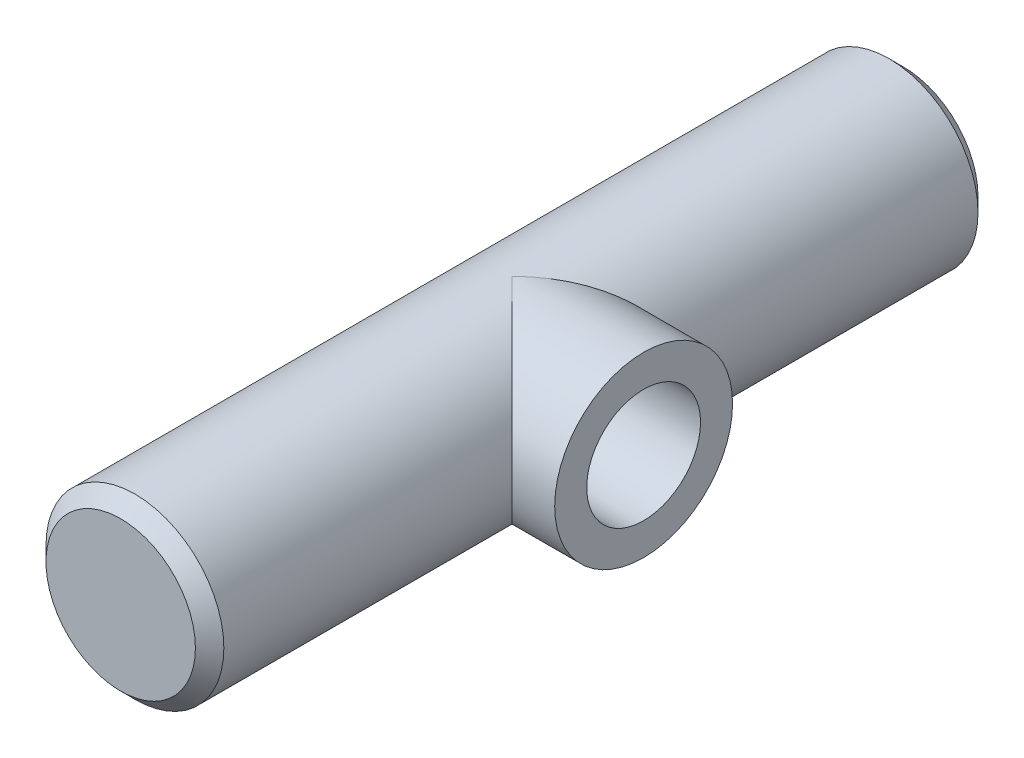
ISO-10303-21;
HEADER;
FILE_DESCRIPTION(('STEP AP214'),'2;1');
FILE_NAME('part.step','',(''),(''),'','','');
FILE_SCHEMA(('AUTOMOTIVE_DESIGN { 1 0 10303 214 1 1 1 1 }'));
ENDSEC;
DATA;
#1=APPLICATION_CONTEXT('core data for automotive mechanical design processes');
#2=APPLICATION_PROTOCOL_DEFINITION('international standard','automotive_design',2000,#1);
#3=PRODUCT_CONTEXT('',#1,'mechanical');
#4=PRODUCT('Part','Part','',(#3));
#5=PRODUCT_RELATED_PRODUCT_CATEGORY('part','',(#4));
#6=PRODUCT_DEFINITION_FORMATION('','',#4);
#7=PRODUCT_DEFINITION_CONTEXT('part definition',#1,'design');
#8=PRODUCT_DEFINITION('design','',#6,#7);
#9=PRODUCT_DEFINITION_SHAPE('','',#8);
#10=(LENGTH_UNIT() NAMED_UNIT(*) SI_UNIT(.MILLI.,.METRE.));
#11=(NAMED_UNIT(*) PLANE_ANGLE_UNIT() SI_UNIT($,.RADIAN.));
#12=(NAMED_UNIT(*) SI_UNIT($,.STERADIAN.) SOLID_ANGLE_UNIT());
#13=UNCERTAINTY_MEASURE_WITH_UNIT(LENGTH_MEASURE(1.E-05),#10,'distance_accuracy_value','');
#14=(GEOMETRIC_REPRESENTATION_CONTEXT(3) GLOBAL_UNCERTAINTY_ASSIGNED_CONTEXT((#13)) GLOBAL_UNIT_ASSIGNED_CONTEXT((#10,
#11,#12)) REPRESENTATION_CONTEXT('',''));
#15=CARTESIAN_POINT('',(0.,0.,0.));
#16=DIRECTION('',(0.,0.,1.));
#17=DIRECTION('',(1.,0.,0.));
#18=AXIS2_PLACEMENT_3D('',#15,#16,#17);
#19=CARTESIAN_POINT('',(0.,0.,110.));
#20=DIRECTION('',(0.,0.,-1.));
#21=DIRECTION('',(-1.,0.,0.));
#22=AXIS2_PLACEMENT_3D('',#19,#20,#21);
#23=CYLINDRICAL_SURFACE('',#22,12.5);
#24=CARTESIAN_POINT('',(0.,0.,108.));
#25=DIRECTION('',(0.,0.,1.));
#26=DIRECTION('',(1.,0.,0.));
#27=AXIS2_PLACEMENT_3D('',#24,#25,#26);
#28=CIRCLE('',#27,12.5);
#29=CARTESIAN_POINT('',(12.5,0.,108.));
#30=VERTEX_POINT('',#29);
#31=EDGE_CURVE('E41',#30,#30,#28,.F.);
#32=ORIENTED_EDGE('',*,*,#31,.T.);
#33=EDGE_LOOP('',(#32));
#34=FACE_BOUND('',#33,.T.);
#35=CARTESIAN_POINT('',(0.,0.,2.00000000000002));
#36=DIRECTION('',(0.,0.,1.));
#37=DIRECTION('',(1.,0.,0.));
#38=AXIS2_PLACEMENT_3D('',#35,#36,#37);
#39=CIRCLE('',#38,12.5);
#40=CARTESIAN_POINT('',(12.5,0.,2.00000000000002));
#41=VERTEX_POINT('',#40);
#42=EDGE_CURVE('E63',#41,#41,#39,.T.);
#43=ORIENTED_EDGE('',*,*,#42,.T.);
#44=EDGE_LOOP('',(#43));
#45=FACE_BOUND('',#44,.T.);
#46=CARTESIAN_POINT('',(0.,0.,55.));
#47=DIRECTION('',(-0.707106781186547,0.,-0.707106781186547));
#48=DIRECTION('',(0.707106781186547,0.,-0.707106781186547));
#49=AXIS2_PLACEMENT_3D('',#46,#47,#48);
#50=ELLIPSE('',#49,17.6776695296637,12.5);
#51=CARTESIAN_POINT('',(0.,-12.5,55.));
#52=VERTEX_POINT('',#51);
#53=CARTESIAN_POINT('',(0.,12.5,55.));
#54=VERTEX_POINT('',#53);
#55=EDGE_CURVE('E49',#52,#54,#50,.F.);
#56=ORIENTED_EDGE('',*,*,#55,.F.);
#57=CARTESIAN_POINT('',(0.,0.,55.));
#58=DIRECTION('',(0.707106781186547,0.,-0.707106781186547));
#59=DIRECTION('',(-0.707106781186547,0.,-0.707106781186547));
#60=AXIS2_PLACEMENT_3D('',#57,#58,#59);
#61=ELLIPSE('',#60,17.6776695296637,12.5);
#62=EDGE_CURVE('E47',#54,#52,#61,.T.);
#63=ORIENTED_EDGE('',*,*,#62,.F.);
#64=EDGE_LOOP('',(#56,#63));
#65=FACE_BOUND('',#64,.T.);
#66=ADVANCED_FACE('F33',(#34,#45,#65),#23,.T.);
#67=CARTESIAN_POINT('',(0.,0.,110.));
#68=DIRECTION('',(0.,0.,1.));
#69=DIRECTION('',(1.,0.,0.));
#70=AXIS2_PLACEMENT_3D('',#67,#68,#69);
#71=PLANE('',#70);
#72=CARTESIAN_POINT('',(0.,0.,110.));
#73=DIRECTION('',(0.,0.,1.));
#74=DIRECTION('',(1.,0.,0.));
#75=AXIS2_PLACEMENT_3D('',#72,#73,#74);
#76=CIRCLE('',#75,10.5);
#77=CARTESIAN_POINT('',(10.5,0.,110.));
#78=VERTEX_POINT('',#77);
#79=EDGE_CURVE('E51',#78,#78,#76,.T.);
#80=ORIENTED_EDGE('',*,*,#79,.T.);
#81=EDGE_LOOP('',(#80));
#82=FACE_BOUND('',#81,.T.);
#83=ADVANCED_FACE('F76',(#82),#71,.T.);
#84=CARTESIAN_POINT('',(0.,0.,0.));
#85=DIRECTION('',(0.,0.,1.));
#86=DIRECTION('',(1.,0.,0.));
#87=AXIS2_PLACEMENT_3D('',#84,#85,#86);
#88=PLANE('',#87);
#89=CARTESIAN_POINT('',(0.,0.,0.));
#90=DIRECTION('',(0.,0.,1.));
#91=DIRECTION('',(1.,0.,0.));
#92=AXIS2_PLACEMENT_3D('',#89,#90,#91);
#93=CIRCLE('',#92,10.5);
#94=CARTESIAN_POINT('',(10.5,0.,0.));
#95=VERTEX_POINT('',#94);
#96=EDGE_CURVE('E11',#95,#95,#93,.F.);
#97=ORIENTED_EDGE('',*,*,#96,.T.);
#98=EDGE_LOOP('',(#97));
#99=FACE_BOUND('',#98,.T.);
#100=ADVANCED_FACE('F78',(#99),#88,.F.);
#101=CARTESIAN_POINT('',(18.5,0.,55.));
#102=DIRECTION('',(-1.,0.,0.));
#103=DIRECTION('',(0.,0.,1.));
#104=AXIS2_PLACEMENT_3D('',#101,#102,#103);
#105=CYLINDRICAL_SURFACE('',#104,12.5);
#106=CARTESIAN_POINT('',(18.5,0.,55.));
#107=DIRECTION('',(1.,0.,0.));
#108=DIRECTION('',(0.,0.,-1.));
#109=AXIS2_PLACEMENT_3D('',#106,#107,#108);
#110=CIRCLE('',#109,12.5);
#111=CARTESIAN_POINT('',(18.5,0.,42.5));
#112=VERTEX_POINT('',#111);
#113=EDGE_CURVE('E54',#112,#112,#110,.T.);
#114=ORIENTED_EDGE('',*,*,#113,.F.);
#115=EDGE_LOOP('',(#114));
#116=FACE_BOUND('',#115,.T.);
#117=ORIENTED_EDGE('',*,*,#62,.T.);
#118=ORIENTED_EDGE('',*,*,#55,.T.);
#119=EDGE_LOOP('',(#117,#118));
#120=FACE_BOUND('',#119,.T.);
#121=ADVANCED_FACE('F53',(#116,#120),#105,.T.);
#122=CARTESIAN_POINT('',(18.5,0.,55.));
#123=DIRECTION('',(1.,0.,0.));
#124=DIRECTION('',(0.,0.,-1.));
#125=AXIS2_PLACEMENT_3D('',#122,#123,#124);
#126=PLANE('',#125);
#127=CARTESIAN_POINT('',(18.5,0.,55.));
#128=DIRECTION('',(1.,0.,0.));
#129=DIRECTION('',(0.,0.,-1.));
#130=AXIS2_PLACEMENT_3D('',#127,#128,#129);
#131=CIRCLE('',#130,8.);
#132=CARTESIAN_POINT('',(18.5,0.,47.));
#133=VERTEX_POINT('',#132);
#134=EDGE_CURVE('E105',#133,#133,#131,.T.);
#135=ORIENTED_EDGE('',*,*,#134,.F.);
#136=EDGE_LOOP('',(#135));
#137=FACE_BOUND('',#136,.T.);
#138=ORIENTED_EDGE('',*,*,#113,.T.);
#139=EDGE_LOOP('',(#138));
#140=FACE_BOUND('',#139,.T.);
#141=ADVANCED_FACE('F73',(#137,#140),#126,.T.);
#142=CARTESIAN_POINT('',(0.,0.,110.));
#143=DIRECTION('',(0.,0.,-1.));
#144=DIRECTION('',(-1.,0.,0.));
#145=AXIS2_PLACEMENT_3D('',#142,#143,#144);
#146=CONICAL_SURFACE('',#145,10.5,0.785398163397449);
#147=ORIENTED_EDGE('',*,*,#31,.F.);
#148=EDGE_LOOP('',(#147));
#149=FACE_BOUND('',#148,.T.);
#150=ORIENTED_EDGE('',*,*,#79,.F.);
#151=EDGE_LOOP('',(#150));
#152=FACE_BOUND('',#151,.T.);
#153=ADVANCED_FACE('F70',(#149,#152),#146,.T.);
#154=CARTESIAN_POINT('',(0.,0.,2.00000000000002));
#155=DIRECTION('',(0.,0.,1.));
#156=DIRECTION('',(1.,0.,0.));
#157=AXIS2_PLACEMENT_3D('',#154,#155,#156);
#158=CONICAL_SURFACE('',#157,12.5,0.785398163397449);
#159=ORIENTED_EDGE('',*,*,#96,.F.);
#160=EDGE_LOOP('',(#159));
#161=FACE_BOUND('',#160,.T.);
#162=ORIENTED_EDGE('',*,*,#42,.F.);
#163=EDGE_LOOP('',(#162));
#164=FACE_BOUND('',#163,.T.);
#165=ADVANCED_FACE('F35',(#161,#164),#158,.T.);
#166=CARTESIAN_POINT('',(0.,0.,55.));
#167=DIRECTION('',(1.,0.,0.));
#168=DIRECTION('',(0.,0.,-1.));
#169=AXIS2_PLACEMENT_3D('',#166,#167,#168);
#170=CYLINDRICAL_SURFACE('',#169,8.);
#171=CARTESIAN_POINT('',(0.,0.,55.));
#172=DIRECTION('',(1.,0.,0.));
#173=DIRECTION('',(0.,0.,-1.));
#174=AXIS2_PLACEMENT_3D('',#171,#172,#173);
#175=CIRCLE('',#174,8.);
#176=CARTESIAN_POINT('',(0.,0.,47.));
#177=VERTEX_POINT('',#176);
#178=EDGE_CURVE('E57',#177,#177,#175,.T.);
#179=ORIENTED_EDGE('',*,*,#178,.F.);
#180=EDGE_LOOP('',(#179));
#181=FACE_BOUND('',#180,.T.);
#182=ORIENTED_EDGE('',*,*,#134,.T.);
#183=EDGE_LOOP('',(#182));
#184=FACE_BOUND('',#183,.T.);
#185=ADVANCED_FACE('F94',(#181,#184),#170,.F.);
#186=CARTESIAN_POINT('',(0.,0.,55.));
#187=DIRECTION('',(1.,0.,0.));
#188=DIRECTION('',(0.,0.,-1.));
#189=AXIS2_PLACEMENT_3D('',#186,#187,#188);
#190=PLANE('',#189);
#191=ORIENTED_EDGE('',*,*,#178,.T.);
#192=EDGE_LOOP('',(#191));
#193=FACE_BOUND('',#192,.T.);
#194=ADVANCED_FACE('F97',(#193),#190,.T.);
#195=CLOSED_SHELL('',(#66,#83,#100,#121,#141,#153,#165,#185,#194));
#196=MANIFOLD_SOLID_BREP('B2',#195);
#197=ADVANCED_BREP_SHAPE_REPRESENTATION('',(#18,#196),#14);
#198=SHAPE_DEFINITION_REPRESENTATION(#9,#197);
ENDSEC;
END-ISO-10303-21;
